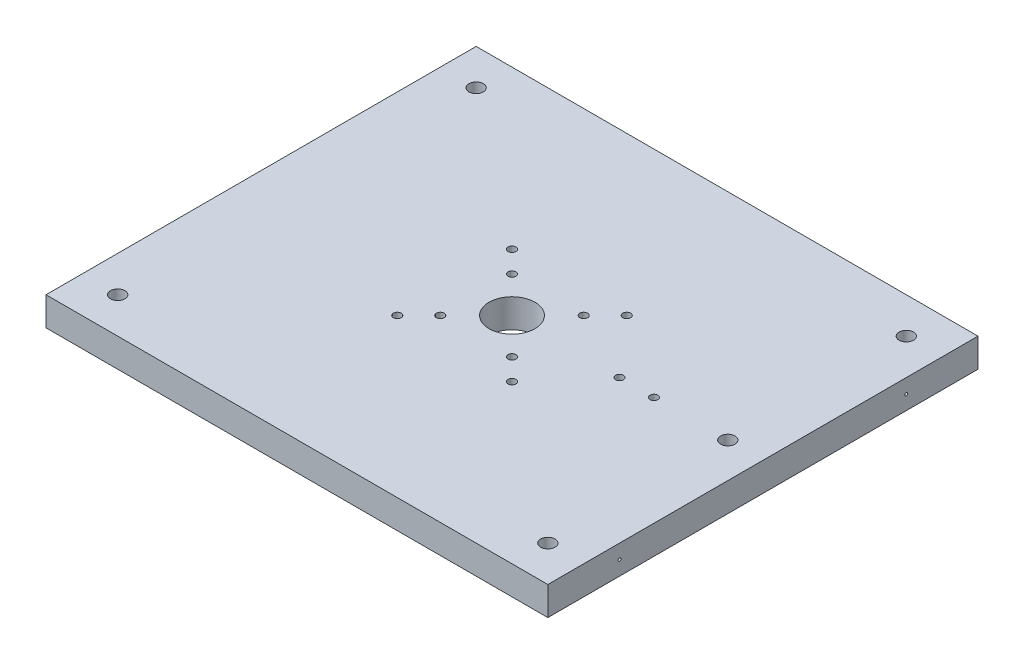
ISO-10303-21;
HEADER;
FILE_DESCRIPTION(('STEP AP214'),'2;1');
FILE_NAME('part.step','',(''),(''),'','','');
FILE_SCHEMA(('AUTOMOTIVE_DESIGN { 1 0 10303 214 1 1 1 1 }'));
ENDSEC;
DATA;
#1=APPLICATION_CONTEXT('core data for automotive mechanical design processes');
#2=APPLICATION_PROTOCOL_DEFINITION('international standard','automotive_design',2000,#1);
#3=PRODUCT_CONTEXT('',#1,'mechanical');
#4=PRODUCT('Part','Part','',(#3));
#5=PRODUCT_RELATED_PRODUCT_CATEGORY('part','',(#4));
#6=PRODUCT_DEFINITION_FORMATION('','',#4);
#7=PRODUCT_DEFINITION_CONTEXT('part definition',#1,'design');
#8=PRODUCT_DEFINITION('design','',#6,#7);
#9=PRODUCT_DEFINITION_SHAPE('','',#8);
#10=(LENGTH_UNIT() NAMED_UNIT(*) SI_UNIT(.MILLI.,.METRE.));
#11=(NAMED_UNIT(*) PLANE_ANGLE_UNIT() SI_UNIT($,.RADIAN.));
#12=(NAMED_UNIT(*) SI_UNIT($,.STERADIAN.) SOLID_ANGLE_UNIT());
#13=UNCERTAINTY_MEASURE_WITH_UNIT(LENGTH_MEASURE(1.E-05),#10,'distance_accuracy_value','');
#14=(GEOMETRIC_REPRESENTATION_CONTEXT(3) GLOBAL_UNCERTAINTY_ASSIGNED_CONTEXT((#13)) GLOBAL_UNIT_ASSIGNED_CONTEXT((#10,
#11,#12)) REPRESENTATION_CONTEXT('',''));
#15=CARTESIAN_POINT('',(0.,0.,0.));
#16=DIRECTION('',(0.,0.,1.));
#17=DIRECTION('',(1.,0.,0.));
#18=AXIS2_PLACEMENT_3D('',#15,#16,#17);
#19=CARTESIAN_POINT('',(-175.,20.,-150.));
#20=DIRECTION('',(1.,0.,0.));
#21=DIRECTION('',(0.,0.,-1.));
#22=AXIS2_PLACEMENT_3D('',#19,#20,#21);
#23=PLANE('',#22);
#24=DIRECTION('',(0.,0.,1.));
#25=VECTOR('',#24,1.);
#26=CARTESIAN_POINT('',(-175.,0.,-150.));
#27=LINE('',#26,#25);
#28=CARTESIAN_POINT('',(-175.,0.,-150.));
#29=VERTEX_POINT('',#28);
#30=CARTESIAN_POINT('',(-175.,0.,150.));
#31=VERTEX_POINT('',#30);
#32=EDGE_CURVE('E97',#29,#31,#27,.T.);
#33=ORIENTED_EDGE('',*,*,#32,.T.);
#34=DIRECTION('',(0.,-1.,0.));
#35=VECTOR('',#34,1.);
#36=CARTESIAN_POINT('',(-175.,20.,150.));
#37=LINE('',#36,#35);
#38=CARTESIAN_POINT('',(-175.,20.,150.));
#39=VERTEX_POINT('',#38);
#40=EDGE_CURVE('E11',#39,#31,#37,.T.);
#41=ORIENTED_EDGE('',*,*,#40,.F.);
#42=DIRECTION('',(0.,0.,1.));
#43=VECTOR('',#42,1.);
#44=CARTESIAN_POINT('',(-175.,20.,-150.));
#45=LINE('',#44,#43);
#46=CARTESIAN_POINT('',(-175.,20.,-150.));
#47=VERTEX_POINT('',#46);
#48=EDGE_CURVE('E85',#47,#39,#45,.T.);
#49=ORIENTED_EDGE('',*,*,#48,.F.);
#50=DIRECTION('',(0.,-1.,0.));
#51=VECTOR('',#50,1.);
#52=CARTESIAN_POINT('',(-175.,20.,-150.));
#53=LINE('',#52,#51);
#54=EDGE_CURVE('E93',#47,#29,#53,.T.);
#55=ORIENTED_EDGE('',*,*,#54,.T.);
#56=EDGE_LOOP('',(#33,#41,#49,#55));
#57=FACE_BOUND('',#56,.T.);
#58=ADVANCED_FACE('F34',(#57),#23,.F.);
#59=CARTESIAN_POINT('',(175.,20.,150.));
#60=DIRECTION('',(0.,0.,-1.));
#61=DIRECTION('',(-1.,0.,0.));
#62=AXIS2_PLACEMENT_3D('',#59,#60,#61);
#63=PLANE('',#62);
#64=DIRECTION('',(1.,0.,0.));
#65=VECTOR('',#64,1.);
#66=CARTESIAN_POINT('',(175.,0.,150.));
#67=LINE('',#66,#65);
#68=CARTESIAN_POINT('',(175.,0.,150.));
#69=VERTEX_POINT('',#68);
#70=EDGE_CURVE('E89',#31,#69,#67,.T.);
#71=ORIENTED_EDGE('',*,*,#70,.T.);
#72=DIRECTION('',(0.,-1.,0.));
#73=VECTOR('',#72,1.);
#74=CARTESIAN_POINT('',(175.,20.,150.));
#75=LINE('',#74,#73);
#76=CARTESIAN_POINT('',(175.,20.,150.));
#77=VERTEX_POINT('',#76);
#78=EDGE_CURVE('E42',#77,#69,#75,.T.);
#79=ORIENTED_EDGE('',*,*,#78,.F.);
#80=DIRECTION('',(1.,0.,0.));
#81=VECTOR('',#80,1.);
#82=CARTESIAN_POINT('',(175.,20.,150.));
#83=LINE('',#82,#81);
#84=EDGE_CURVE('E80',#39,#77,#83,.T.);
#85=ORIENTED_EDGE('',*,*,#84,.F.);
#86=ORIENTED_EDGE('',*,*,#40,.T.);
#87=EDGE_LOOP('',(#71,#79,#85,#86));
#88=FACE_BOUND('',#87,.T.);
#89=ADVANCED_FACE('F88',(#88),#63,.F.);
#90=CARTESIAN_POINT('',(175.,20.,-150.));
#91=DIRECTION('',(-1.,0.,0.));
#92=DIRECTION('',(0.,0.,1.));
#93=AXIS2_PLACEMENT_3D('',#90,#91,#92);
#94=PLANE('',#93);
#95=CARTESIAN_POINT('',(175.,10.,100.));
#96=DIRECTION('',(1.,0.,0.));
#97=DIRECTION('',(0.,0.,-1.));
#98=AXIS2_PLACEMENT_3D('',#95,#96,#97);
#99=CIRCLE('',#98,0.999999999999998);
#100=CARTESIAN_POINT('',(175.,10.,99.));
#101=VERTEX_POINT('',#100);
#102=EDGE_CURVE('E213',#101,#101,#99,.T.);
#103=ORIENTED_EDGE('',*,*,#102,.F.);
#104=EDGE_LOOP('',(#103));
#105=FACE_BOUND('',#104,.T.);
#106=CARTESIAN_POINT('',(175.,10.,-100.));
#107=DIRECTION('',(1.,0.,0.));
#108=DIRECTION('',(0.,0.,-1.));
#109=AXIS2_PLACEMENT_3D('',#106,#107,#108);
#110=CIRCLE('',#109,0.999999999999998);
#111=CARTESIAN_POINT('',(175.,10.,-101.));
#112=VERTEX_POINT('',#111);
#113=EDGE_CURVE('E207',#112,#112,#110,.T.);
#114=ORIENTED_EDGE('',*,*,#113,.F.);
#115=EDGE_LOOP('',(#114));
#116=FACE_BOUND('',#115,.T.);
#117=DIRECTION('',(0.,0.,-1.));
#118=VECTOR('',#117,1.);
#119=CARTESIAN_POINT('',(175.,0.,-150.));
#120=LINE('',#119,#118);
#121=CARTESIAN_POINT('',(175.,0.,-150.));
#122=VERTEX_POINT('',#121);
#123=EDGE_CURVE('E67',#69,#122,#120,.T.);
#124=ORIENTED_EDGE('',*,*,#123,.T.);
#125=DIRECTION('',(0.,-1.,0.));
#126=VECTOR('',#125,1.);
#127=CARTESIAN_POINT('',(175.,20.,-150.));
#128=LINE('',#127,#126);
#129=CARTESIAN_POINT('',(175.,20.,-150.));
#130=VERTEX_POINT('',#129);
#131=EDGE_CURVE('E90',#130,#122,#128,.T.);
#132=ORIENTED_EDGE('',*,*,#131,.F.);
#133=DIRECTION('',(0.,0.,-1.));
#134=VECTOR('',#133,1.);
#135=CARTESIAN_POINT('',(175.,20.,-150.));
#136=LINE('',#135,#134);
#137=EDGE_CURVE('E83',#77,#130,#136,.T.);
#138=ORIENTED_EDGE('',*,*,#137,.F.);
#139=ORIENTED_EDGE('',*,*,#78,.T.);
#140=EDGE_LOOP('',(#124,#132,#138,#139));
#141=FACE_BOUND('',#140,.T.);
#142=ADVANCED_FACE('F91',(#105,#116,#141),#94,.F.);
#143=CARTESIAN_POINT('',(175.,20.,-150.));
#144=DIRECTION('',(0.,0.,1.));
#145=DIRECTION('',(1.,0.,0.));
#146=AXIS2_PLACEMENT_3D('',#143,#144,#145);
#147=PLANE('',#146);
#148=DIRECTION('',(-1.,0.,0.));
#149=VECTOR('',#148,1.);
#150=CARTESIAN_POINT('',(175.,0.,-150.));
#151=LINE('',#150,#149);
#152=EDGE_CURVE('E73',#122,#29,#151,.T.);
#153=ORIENTED_EDGE('',*,*,#152,.T.);
#154=ORIENTED_EDGE('',*,*,#54,.F.);
#155=DIRECTION('',(-1.,0.,0.));
#156=VECTOR('',#155,1.);
#157=CARTESIAN_POINT('',(175.,20.,-150.));
#158=LINE('',#157,#156);
#159=EDGE_CURVE('E50',#130,#47,#158,.T.);
#160=ORIENTED_EDGE('',*,*,#159,.F.);
#161=ORIENTED_EDGE('',*,*,#131,.T.);
#162=EDGE_LOOP('',(#153,#154,#160,#161));
#163=FACE_BOUND('',#162,.T.);
#164=ADVANCED_FACE('F105',(#163),#147,.F.);
#165=CARTESIAN_POINT('',(0.,20.,0.));
#166=DIRECTION('',(0.,-1.,0.));
#167=DIRECTION('',(0.,0.,-1.));
#168=AXIS2_PLACEMENT_3D('',#165,#166,#167);
#169=PLANE('',#168);
#170=CARTESIAN_POINT('',(-24.9999999999995,20.,25.));
#171=DIRECTION('',(0.,1.,0.));
#172=DIRECTION('',(0.,0.,1.));
#173=AXIS2_PLACEMENT_3D('',#170,#171,#172);
#174=CIRCLE('',#173,2.75);
#175=CARTESIAN_POINT('',(-24.9999999999995,20.,27.75));
#176=VERTEX_POINT('',#175);
#177=EDGE_CURVE('E189',#176,#176,#174,.T.);
#178=ORIENTED_EDGE('',*,*,#177,.F.);
#179=EDGE_LOOP('',(#178));
#180=FACE_BOUND('',#179,.T.);
#181=CARTESIAN_POINT('',(25.0000000000005,20.,25.));
#182=DIRECTION('',(0.,1.,0.));
#183=DIRECTION('',(0.,0.,1.));
#184=AXIS2_PLACEMENT_3D('',#181,#182,#183);
#185=CIRCLE('',#184,2.75);
#186=CARTESIAN_POINT('',(25.0000000000005,20.,27.75));
#187=VERTEX_POINT('',#186);
#188=EDGE_CURVE('E196',#187,#187,#185,.T.);
#189=ORIENTED_EDGE('',*,*,#188,.F.);
#190=EDGE_LOOP('',(#189));
#191=FACE_BOUND('',#190,.T.);
#192=CARTESIAN_POINT('',(25.,20.,-25.));
#193=DIRECTION('',(0.,1.,0.));
#194=DIRECTION('',(0.,0.,1.));
#195=AXIS2_PLACEMENT_3D('',#192,#193,#194);
#196=CIRCLE('',#195,2.75);
#197=CARTESIAN_POINT('',(25.,20.,-22.25));
#198=VERTEX_POINT('',#197);
#199=EDGE_CURVE('E202',#198,#198,#196,.T.);
#200=ORIENTED_EDGE('',*,*,#199,.F.);
#201=EDGE_LOOP('',(#200));
#202=FACE_BOUND('',#201,.T.);
#203=CARTESIAN_POINT('',(-25.,20.,-25.));
#204=DIRECTION('',(0.,1.,0.));
#205=DIRECTION('',(0.,0.,1.));
#206=AXIS2_PLACEMENT_3D('',#203,#204,#205);
#207=CIRCLE('',#206,2.75);
#208=CARTESIAN_POINT('',(-25.,20.,-22.25));
#209=VERTEX_POINT('',#208);
#210=EDGE_CURVE('E183',#209,#209,#207,.T.);
#211=ORIENTED_EDGE('',*,*,#210,.F.);
#212=EDGE_LOOP('',(#211));
#213=FACE_BOUND('',#212,.T.);
#214=CARTESIAN_POINT('',(0.,20.,0.));
#215=DIRECTION('',(0.,1.,0.));
#216=DIRECTION('',(0.,0.,1.));
#217=AXIS2_PLACEMENT_3D('',#214,#215,#216);
#218=CIRCLE('',#217,16.);
#219=CARTESIAN_POINT('',(0.,20.,16.));
#220=VERTEX_POINT('',#219);
#221=EDGE_CURVE('E177',#220,#220,#218,.T.);
#222=ORIENTED_EDGE('',*,*,#221,.F.);
#223=EDGE_LOOP('',(#222));
#224=FACE_BOUND('',#223,.T.);
#225=CARTESIAN_POINT('',(-39.9999999999992,20.,40.));
#226=DIRECTION('',(0.,1.,0.));
#227=DIRECTION('',(0.,0.,1.));
#228=AXIS2_PLACEMENT_3D('',#225,#226,#227);
#229=CIRCLE('',#228,2.75);
#230=CARTESIAN_POINT('',(-39.9999999999992,20.,42.75));
#231=VERTEX_POINT('',#230);
#232=EDGE_CURVE('E159',#231,#231,#229,.T.);
#233=ORIENTED_EDGE('',*,*,#232,.F.);
#234=EDGE_LOOP('',(#233));
#235=FACE_BOUND('',#234,.T.);
#236=CARTESIAN_POINT('',(40.0000000000008,20.,40.));
#237=DIRECTION('',(0.,1.,0.));
#238=DIRECTION('',(0.,0.,1.));
#239=AXIS2_PLACEMENT_3D('',#236,#237,#238);
#240=CIRCLE('',#239,2.75);
#241=CARTESIAN_POINT('',(40.0000000000008,20.,42.75));
#242=VERTEX_POINT('',#241);
#243=EDGE_CURVE('E166',#242,#242,#240,.T.);
#244=ORIENTED_EDGE('',*,*,#243,.F.);
#245=EDGE_LOOP('',(#244));
#246=FACE_BOUND('',#245,.T.);
#247=CARTESIAN_POINT('',(40.,20.,-40.));
#248=DIRECTION('',(0.,1.,0.));
#249=DIRECTION('',(0.,0.,1.));
#250=AXIS2_PLACEMENT_3D('',#247,#248,#249);
#251=CIRCLE('',#250,2.75);
#252=CARTESIAN_POINT('',(40.,20.,-37.25));
#253=VERTEX_POINT('',#252);
#254=EDGE_CURVE('E172',#253,#253,#251,.T.);
#255=ORIENTED_EDGE('',*,*,#254,.F.);
#256=EDGE_LOOP('',(#255));
#257=FACE_BOUND('',#256,.T.);
#258=CARTESIAN_POINT('',(-40.,20.,-40.));
#259=DIRECTION('',(0.,1.,0.));
#260=DIRECTION('',(0.,0.,1.));
#261=AXIS2_PLACEMENT_3D('',#258,#259,#260);
#262=CIRCLE('',#261,2.75);
#263=CARTESIAN_POINT('',(-40.,20.,-37.25));
#264=VERTEX_POINT('',#263);
#265=EDGE_CURVE('E153',#264,#264,#262,.T.);
#266=ORIENTED_EDGE('',*,*,#265,.F.);
#267=EDGE_LOOP('',(#266));
#268=FACE_BOUND('',#267,.T.);
#269=CARTESIAN_POINT('',(150.5,20.,0.));
#270=DIRECTION('',(0.,1.,0.));
#271=DIRECTION('',(0.,0.,1.));
#272=AXIS2_PLACEMENT_3D('',#269,#270,#271);
#273=CIRCLE('',#272,5.00000000000002);
#274=CARTESIAN_POINT('',(150.5,20.,5.00000000000002));
#275=VERTEX_POINT('',#274);
#276=EDGE_CURVE('E147',#275,#275,#273,.T.);
#277=ORIENTED_EDGE('',*,*,#276,.F.);
#278=EDGE_LOOP('',(#277));
#279=FACE_BOUND('',#278,.T.);
#280=CARTESIAN_POINT('',(75.0000000000001,20.,0.));
#281=DIRECTION('',(0.,1.,0.));
#282=DIRECTION('',(0.,0.,1.));
#283=AXIS2_PLACEMENT_3D('',#280,#281,#282);
#284=CIRCLE('',#283,2.75000000000001);
#285=CARTESIAN_POINT('',(75.0000000000001,20.,2.75000000000001));
#286=VERTEX_POINT('',#285);
#287=EDGE_CURVE('E142',#286,#286,#284,.T.);
#288=ORIENTED_EDGE('',*,*,#287,.F.);
#289=EDGE_LOOP('',(#288));
#290=FACE_BOUND('',#289,.T.);
#291=CARTESIAN_POINT('',(99.0000000000001,20.,0.));
#292=DIRECTION('',(0.,1.,0.));
#293=DIRECTION('',(0.,0.,1.));
#294=AXIS2_PLACEMENT_3D('',#291,#292,#293);
#295=CIRCLE('',#294,2.75000000000001);
#296=CARTESIAN_POINT('',(99.0000000000001,20.,2.75000000000001));
#297=VERTEX_POINT('',#296);
#298=EDGE_CURVE('E135',#297,#297,#295,.T.);
#299=ORIENTED_EDGE('',*,*,#298,.F.);
#300=EDGE_LOOP('',(#299));
#301=FACE_BOUND('',#300,.T.);
#302=CARTESIAN_POINT('',(150.,20.,125.));
#303=DIRECTION('',(0.,1.,0.));
#304=DIRECTION('',(0.,0.,1.));
#305=AXIS2_PLACEMENT_3D('',#302,#303,#304);
#306=CIRCLE('',#305,5.00000000000002);
#307=CARTESIAN_POINT('',(150.,20.,130.));
#308=VERTEX_POINT('',#307);
#309=EDGE_CURVE('E117',#308,#308,#306,.T.);
#310=ORIENTED_EDGE('',*,*,#309,.F.);
#311=EDGE_LOOP('',(#310));
#312=FACE_BOUND('',#311,.T.);
#313=CARTESIAN_POINT('',(150.,20.,-125.));
#314=DIRECTION('',(0.,1.,0.));
#315=DIRECTION('',(0.,0.,1.));
#316=AXIS2_PLACEMENT_3D('',#313,#314,#315);
#317=CIRCLE('',#316,5.00000000000002);
#318=CARTESIAN_POINT('',(150.,20.,-120.));
#319=VERTEX_POINT('',#318);
#320=EDGE_CURVE('E124',#319,#319,#317,.T.);
#321=ORIENTED_EDGE('',*,*,#320,.F.);
#322=EDGE_LOOP('',(#321));
#323=FACE_BOUND('',#322,.T.);
#324=CARTESIAN_POINT('',(-150.,20.,-125.));
#325=DIRECTION('',(0.,1.,0.));
#326=DIRECTION('',(0.,0.,1.));
#327=AXIS2_PLACEMENT_3D('',#324,#325,#326);
#328=CIRCLE('',#327,5.00000000000002);
#329=CARTESIAN_POINT('',(-150.,20.,-120.));
#330=VERTEX_POINT('',#329);
#331=EDGE_CURVE('E130',#330,#330,#328,.T.);
#332=ORIENTED_EDGE('',*,*,#331,.F.);
#333=EDGE_LOOP('',(#332));
#334=FACE_BOUND('',#333,.T.);
#335=CARTESIAN_POINT('',(-150.,20.,125.));
#336=DIRECTION('',(0.,1.,0.));
#337=DIRECTION('',(0.,0.,1.));
#338=AXIS2_PLACEMENT_3D('',#335,#336,#337);
#339=CIRCLE('',#338,5.00000000000002);
#340=CARTESIAN_POINT('',(-150.,20.,130.));
#341=VERTEX_POINT('',#340);
#342=EDGE_CURVE('E111',#341,#341,#339,.T.);
#343=ORIENTED_EDGE('',*,*,#342,.F.);
#344=EDGE_LOOP('',(#343));
#345=FACE_BOUND('',#344,.T.);
#346=ORIENTED_EDGE('',*,*,#48,.T.);
#347=ORIENTED_EDGE('',*,*,#84,.T.);
#348=ORIENTED_EDGE('',*,*,#137,.T.);
#349=ORIENTED_EDGE('',*,*,#159,.T.);
#350=EDGE_LOOP('',(#346,#347,#348,#349));
#351=FACE_BOUND('',#350,.T.);
#352=ADVANCED_FACE('F81',(#180,#191,#202,#213,#224,#235,#246,#257,#268,#279,#290,#301,#312,#323,
#334,#345,#351),#169,.F.);
#353=CARTESIAN_POINT('',(0.,0.,0.));
#354=DIRECTION('',(0.,-1.,0.));
#355=DIRECTION('',(0.,0.,-1.));
#356=AXIS2_PLACEMENT_3D('',#353,#354,#355);
#357=PLANE('',#356);
#358=CARTESIAN_POINT('',(-24.9999999999995,0.,25.));
#359=DIRECTION('',(0.,1.,0.));
#360=DIRECTION('',(0.,0.,1.));
#361=AXIS2_PLACEMENT_3D('',#358,#359,#360);
#362=CIRCLE('',#361,2.75);
#363=CARTESIAN_POINT('',(-24.9999999999995,0.,27.75));
#364=VERTEX_POINT('',#363);
#365=EDGE_CURVE('E192',#364,#364,#362,.T.);
#366=ORIENTED_EDGE('',*,*,#365,.T.);
#367=EDGE_LOOP('',(#366));
#368=FACE_BOUND('',#367,.T.);
#369=CARTESIAN_POINT('',(25.0000000000005,0.,25.));
#370=DIRECTION('',(0.,1.,0.));
#371=DIRECTION('',(0.,0.,1.));
#372=AXIS2_PLACEMENT_3D('',#369,#370,#371);
#373=CIRCLE('',#372,2.75);
#374=CARTESIAN_POINT('',(25.0000000000005,0.,27.75));
#375=VERTEX_POINT('',#374);
#376=EDGE_CURVE('E199',#375,#375,#373,.T.);
#377=ORIENTED_EDGE('',*,*,#376,.T.);
#378=EDGE_LOOP('',(#377));
#379=FACE_BOUND('',#378,.T.);
#380=CARTESIAN_POINT('',(25.,0.,-25.));
#381=DIRECTION('',(0.,1.,0.));
#382=DIRECTION('',(0.,0.,1.));
#383=AXIS2_PLACEMENT_3D('',#380,#381,#382);
#384=CIRCLE('',#383,2.75);
#385=CARTESIAN_POINT('',(25.,0.,-22.25));
#386=VERTEX_POINT('',#385);
#387=EDGE_CURVE('E186',#386,#386,#384,.T.);
#388=ORIENTED_EDGE('',*,*,#387,.T.);
#389=EDGE_LOOP('',(#388));
#390=FACE_BOUND('',#389,.T.);
#391=CARTESIAN_POINT('',(-25.,0.,-25.));
#392=DIRECTION('',(0.,1.,0.));
#393=DIRECTION('',(0.,0.,1.));
#394=AXIS2_PLACEMENT_3D('',#391,#392,#393);
#395=CIRCLE('',#394,2.75);
#396=CARTESIAN_POINT('',(-25.,0.,-22.25));
#397=VERTEX_POINT('',#396);
#398=EDGE_CURVE('E180',#397,#397,#395,.T.);
#399=ORIENTED_EDGE('',*,*,#398,.T.);
#400=EDGE_LOOP('',(#399));
#401=FACE_BOUND('',#400,.T.);
#402=CARTESIAN_POINT('',(0.,0.,0.));
#403=DIRECTION('',(0.,1.,0.));
#404=DIRECTION('',(0.,0.,1.));
#405=AXIS2_PLACEMENT_3D('',#402,#403,#404);
#406=CIRCLE('',#405,16.);
#407=CARTESIAN_POINT('',(0.,0.,16.));
#408=VERTEX_POINT('',#407);
#409=EDGE_CURVE('E163',#408,#408,#406,.T.);
#410=ORIENTED_EDGE('',*,*,#409,.T.);
#411=EDGE_LOOP('',(#410));
#412=FACE_BOUND('',#411,.T.);
#413=CARTESIAN_POINT('',(-39.9999999999992,0.,40.));
#414=DIRECTION('',(0.,1.,0.));
#415=DIRECTION('',(0.,0.,1.));
#416=AXIS2_PLACEMENT_3D('',#413,#414,#415);
#417=CIRCLE('',#416,2.75);
#418=CARTESIAN_POINT('',(-39.9999999999992,0.,42.75));
#419=VERTEX_POINT('',#418);
#420=EDGE_CURVE('E162',#419,#419,#417,.T.);
#421=ORIENTED_EDGE('',*,*,#420,.T.);
#422=EDGE_LOOP('',(#421));
#423=FACE_BOUND('',#422,.T.);
#424=CARTESIAN_POINT('',(40.0000000000008,0.,40.));
#425=DIRECTION('',(0.,1.,0.));
#426=DIRECTION('',(0.,0.,1.));
#427=AXIS2_PLACEMENT_3D('',#424,#425,#426);
#428=CIRCLE('',#427,2.75);
#429=CARTESIAN_POINT('',(40.0000000000008,0.,42.75));
#430=VERTEX_POINT('',#429);
#431=EDGE_CURVE('E169',#430,#430,#428,.T.);
#432=ORIENTED_EDGE('',*,*,#431,.T.);
#433=EDGE_LOOP('',(#432));
#434=FACE_BOUND('',#433,.T.);
#435=CARTESIAN_POINT('',(40.,0.,-40.));
#436=DIRECTION('',(0.,1.,0.));
#437=DIRECTION('',(0.,0.,1.));
#438=AXIS2_PLACEMENT_3D('',#435,#436,#437);
#439=CIRCLE('',#438,2.75);
#440=CARTESIAN_POINT('',(40.,0.,-37.25));
#441=VERTEX_POINT('',#440);
#442=EDGE_CURVE('E156',#441,#441,#439,.T.);
#443=ORIENTED_EDGE('',*,*,#442,.T.);
#444=EDGE_LOOP('',(#443));
#445=FACE_BOUND('',#444,.T.);
#446=CARTESIAN_POINT('',(-40.,0.,-40.));
#447=DIRECTION('',(0.,1.,0.));
#448=DIRECTION('',(0.,0.,1.));
#449=AXIS2_PLACEMENT_3D('',#446,#447,#448);
#450=CIRCLE('',#449,2.75);
#451=CARTESIAN_POINT('',(-40.,0.,-37.25));
#452=VERTEX_POINT('',#451);
#453=EDGE_CURVE('E150',#452,#452,#450,.T.);
#454=ORIENTED_EDGE('',*,*,#453,.T.);
#455=EDGE_LOOP('',(#454));
#456=FACE_BOUND('',#455,.T.);
#457=CARTESIAN_POINT('',(150.5,0.,0.));
#458=DIRECTION('',(0.,1.,0.));
#459=DIRECTION('',(0.,0.,1.));
#460=AXIS2_PLACEMENT_3D('',#457,#458,#459);
#461=CIRCLE('',#460,5.00000000000002);
#462=CARTESIAN_POINT('',(150.5,0.,5.00000000000002));
#463=VERTEX_POINT('',#462);
#464=EDGE_CURVE('E139',#463,#463,#461,.T.);
#465=ORIENTED_EDGE('',*,*,#464,.T.);
#466=EDGE_LOOP('',(#465));
#467=FACE_BOUND('',#466,.T.);
#468=CARTESIAN_POINT('',(75.0000000000001,0.,0.));
#469=DIRECTION('',(0.,1.,0.));
#470=DIRECTION('',(0.,0.,1.));
#471=AXIS2_PLACEMENT_3D('',#468,#469,#470);
#472=CIRCLE('',#471,2.75000000000001);
#473=CARTESIAN_POINT('',(75.0000000000001,0.,2.75000000000001));
#474=VERTEX_POINT('',#473);
#475=EDGE_CURVE('E121',#474,#474,#472,.T.);
#476=ORIENTED_EDGE('',*,*,#475,.T.);
#477=EDGE_LOOP('',(#476));
#478=FACE_BOUND('',#477,.T.);
#479=CARTESIAN_POINT('',(99.0000000000001,0.,0.));
#480=DIRECTION('',(0.,1.,0.));
#481=DIRECTION('',(0.,0.,1.));
#482=AXIS2_PLACEMENT_3D('',#479,#480,#481);
#483=CIRCLE('',#482,2.75000000000001);
#484=CARTESIAN_POINT('',(99.0000000000001,0.,2.75000000000001));
#485=VERTEX_POINT('',#484);
#486=EDGE_CURVE('E138',#485,#485,#483,.T.);
#487=ORIENTED_EDGE('',*,*,#486,.T.);
#488=EDGE_LOOP('',(#487));
#489=FACE_BOUND('',#488,.T.);
#490=CARTESIAN_POINT('',(150.,0.,125.));
#491=DIRECTION('',(0.,1.,0.));
#492=DIRECTION('',(0.,0.,1.));
#493=AXIS2_PLACEMENT_3D('',#490,#491,#492);
#494=CIRCLE('',#493,5.00000000000002);
#495=CARTESIAN_POINT('',(150.,0.,130.));
#496=VERTEX_POINT('',#495);
#497=EDGE_CURVE('E120',#496,#496,#494,.T.);
#498=ORIENTED_EDGE('',*,*,#497,.T.);
#499=EDGE_LOOP('',(#498));
#500=FACE_BOUND('',#499,.T.);
#501=CARTESIAN_POINT('',(150.,0.,-125.));
#502=DIRECTION('',(0.,1.,0.));
#503=DIRECTION('',(0.,0.,1.));
#504=AXIS2_PLACEMENT_3D('',#501,#502,#503);
#505=CIRCLE('',#504,5.00000000000002);
#506=CARTESIAN_POINT('',(150.,0.,-120.));
#507=VERTEX_POINT('',#506);
#508=EDGE_CURVE('E127',#507,#507,#505,.T.);
#509=ORIENTED_EDGE('',*,*,#508,.T.);
#510=EDGE_LOOP('',(#509));
#511=FACE_BOUND('',#510,.T.);
#512=CARTESIAN_POINT('',(-150.,0.,-125.));
#513=DIRECTION('',(0.,1.,0.));
#514=DIRECTION('',(0.,0.,1.));
#515=AXIS2_PLACEMENT_3D('',#512,#513,#514);
#516=CIRCLE('',#515,5.00000000000002);
#517=CARTESIAN_POINT('',(-150.,0.,-120.));
#518=VERTEX_POINT('',#517);
#519=EDGE_CURVE('E114',#518,#518,#516,.T.);
#520=ORIENTED_EDGE('',*,*,#519,.T.);
#521=EDGE_LOOP('',(#520));
#522=FACE_BOUND('',#521,.T.);
#523=CARTESIAN_POINT('',(-150.,0.,125.));
#524=DIRECTION('',(0.,1.,0.));
#525=DIRECTION('',(0.,0.,1.));
#526=AXIS2_PLACEMENT_3D('',#523,#524,#525);
#527=CIRCLE('',#526,5.00000000000002);
#528=CARTESIAN_POINT('',(-150.,0.,130.));
#529=VERTEX_POINT('',#528);
#530=EDGE_CURVE('E100',#529,#529,#527,.T.);
#531=ORIENTED_EDGE('',*,*,#530,.T.);
#532=EDGE_LOOP('',(#531));
#533=FACE_BOUND('',#532,.T.);
#534=ORIENTED_EDGE('',*,*,#32,.F.);
#535=ORIENTED_EDGE('',*,*,#152,.F.);
#536=ORIENTED_EDGE('',*,*,#123,.F.);
#537=ORIENTED_EDGE('',*,*,#70,.F.);
#538=EDGE_LOOP('',(#534,#535,#536,#537));
#539=FACE_BOUND('',#538,.T.);
#540=ADVANCED_FACE('F108',(#368,#379,#390,#401,#412,#423,#434,#445,#456,#467,#478,#489,#500,
#511,#522,#533,#539),#357,.T.);
#541=CARTESIAN_POINT('',(-150.,0.,125.));
#542=DIRECTION('',(0.,1.,0.));
#543=DIRECTION('',(0.,0.,1.));
#544=AXIS2_PLACEMENT_3D('',#541,#542,#543);
#545=CYLINDRICAL_SURFACE('',#544,5.00000000000002);
#546=ORIENTED_EDGE('',*,*,#530,.F.);
#547=EDGE_LOOP('',(#546));
#548=FACE_BOUND('',#547,.T.);
#549=ORIENTED_EDGE('',*,*,#342,.T.);
#550=EDGE_LOOP('',(#549));
#551=FACE_BOUND('',#550,.T.);
#552=ADVANCED_FACE('F261',(#548,#551),#545,.F.);
#553=CARTESIAN_POINT('',(-150.,0.,-125.));
#554=DIRECTION('',(0.,1.,0.));
#555=DIRECTION('',(0.,0.,1.));
#556=AXIS2_PLACEMENT_3D('',#553,#554,#555);
#557=CYLINDRICAL_SURFACE('',#556,5.00000000000002);
#558=ORIENTED_EDGE('',*,*,#519,.F.);
#559=EDGE_LOOP('',(#558));
#560=FACE_BOUND('',#559,.T.);
#561=ORIENTED_EDGE('',*,*,#331,.T.);
#562=EDGE_LOOP('',(#561));
#563=FACE_BOUND('',#562,.T.);
#564=ADVANCED_FACE('F268',(#560,#563),#557,.F.);
#565=CARTESIAN_POINT('',(150.,0.,-125.));
#566=DIRECTION('',(0.,1.,0.));
#567=DIRECTION('',(0.,0.,1.));
#568=AXIS2_PLACEMENT_3D('',#565,#566,#567);
#569=CYLINDRICAL_SURFACE('',#568,5.00000000000002);
#570=ORIENTED_EDGE('',*,*,#508,.F.);
#571=EDGE_LOOP('',(#570));
#572=FACE_BOUND('',#571,.T.);
#573=ORIENTED_EDGE('',*,*,#320,.T.);
#574=EDGE_LOOP('',(#573));
#575=FACE_BOUND('',#574,.T.);
#576=ADVANCED_FACE('F274',(#572,#575),#569,.F.);
#577=CARTESIAN_POINT('',(150.,0.,125.));
#578=DIRECTION('',(0.,1.,0.));
#579=DIRECTION('',(0.,0.,1.));
#580=AXIS2_PLACEMENT_3D('',#577,#578,#579);
#581=CYLINDRICAL_SURFACE('',#580,5.00000000000002);
#582=ORIENTED_EDGE('',*,*,#497,.F.);
#583=EDGE_LOOP('',(#582));
#584=FACE_BOUND('',#583,.T.);
#585=ORIENTED_EDGE('',*,*,#309,.T.);
#586=EDGE_LOOP('',(#585));
#587=FACE_BOUND('',#586,.T.);
#588=ADVANCED_FACE('F270',(#584,#587),#581,.F.);
#589=CARTESIAN_POINT('',(99.0000000000001,0.,0.));
#590=DIRECTION('',(0.,1.,0.));
#591=DIRECTION('',(0.,0.,1.));
#592=AXIS2_PLACEMENT_3D('',#589,#590,#591);
#593=CYLINDRICAL_SURFACE('',#592,2.75000000000001);
#594=ORIENTED_EDGE('',*,*,#486,.F.);
#595=EDGE_LOOP('',(#594));
#596=FACE_BOUND('',#595,.T.);
#597=ORIENTED_EDGE('',*,*,#298,.T.);
#598=EDGE_LOOP('',(#597));
#599=FACE_BOUND('',#598,.T.);
#600=ADVANCED_FACE('F273',(#596,#599),#593,.F.);
#601=CARTESIAN_POINT('',(75.0000000000001,0.,0.));
#602=DIRECTION('',(0.,1.,0.));
#603=DIRECTION('',(0.,0.,1.));
#604=AXIS2_PLACEMENT_3D('',#601,#602,#603);
#605=CYLINDRICAL_SURFACE('',#604,2.75000000000001);
#606=ORIENTED_EDGE('',*,*,#475,.F.);
#607=EDGE_LOOP('',(#606));
#608=FACE_BOUND('',#607,.T.);
#609=ORIENTED_EDGE('',*,*,#287,.T.);
#610=EDGE_LOOP('',(#609));
#611=FACE_BOUND('',#610,.T.);
#612=ADVANCED_FACE('F284',(#608,#611),#605,.F.);
#613=CARTESIAN_POINT('',(150.5,0.,0.));
#614=DIRECTION('',(0.,1.,0.));
#615=DIRECTION('',(0.,0.,1.));
#616=AXIS2_PLACEMENT_3D('',#613,#614,#615);
#617=CYLINDRICAL_SURFACE('',#616,5.00000000000002);
#618=ORIENTED_EDGE('',*,*,#464,.F.);
#619=EDGE_LOOP('',(#618));
#620=FACE_BOUND('',#619,.T.);
#621=ORIENTED_EDGE('',*,*,#276,.T.);
#622=EDGE_LOOP('',(#621));
#623=FACE_BOUND('',#622,.T.);
#624=ADVANCED_FACE('F288',(#620,#623),#617,.F.);
#625=CARTESIAN_POINT('',(-40.,0.,-40.));
#626=DIRECTION('',(0.,1.,0.));
#627=DIRECTION('',(0.,0.,1.));
#628=AXIS2_PLACEMENT_3D('',#625,#626,#627);
#629=CYLINDRICAL_SURFACE('',#628,2.75);
#630=ORIENTED_EDGE('',*,*,#453,.F.);
#631=EDGE_LOOP('',(#630));
#632=FACE_BOUND('',#631,.T.);
#633=ORIENTED_EDGE('',*,*,#265,.T.);
#634=EDGE_LOOP('',(#633));
#635=FACE_BOUND('',#634,.T.);
#636=ADVANCED_FACE('F292',(#632,#635),#629,.F.);
#637=CARTESIAN_POINT('',(40.,0.,-40.));
#638=DIRECTION('',(0.,1.,0.));
#639=DIRECTION('',(0.,0.,1.));
#640=AXIS2_PLACEMENT_3D('',#637,#638,#639);
#641=CYLINDRICAL_SURFACE('',#640,2.75);
#642=ORIENTED_EDGE('',*,*,#442,.F.);
#643=EDGE_LOOP('',(#642));
#644=FACE_BOUND('',#643,.T.);
#645=ORIENTED_EDGE('',*,*,#254,.T.);
#646=EDGE_LOOP('',(#645));
#647=FACE_BOUND('',#646,.T.);
#648=ADVANCED_FACE('F296',(#644,#647),#641,.F.);
#649=CARTESIAN_POINT('',(40.0000000000008,0.,40.));
#650=DIRECTION('',(0.,1.,0.));
#651=DIRECTION('',(0.,0.,1.));
#652=AXIS2_PLACEMENT_3D('',#649,#650,#651);
#653=CYLINDRICAL_SURFACE('',#652,2.75);
#654=ORIENTED_EDGE('',*,*,#431,.F.);
#655=EDGE_LOOP('',(#654));
#656=FACE_BOUND('',#655,.T.);
#657=ORIENTED_EDGE('',*,*,#243,.T.);
#658=EDGE_LOOP('',(#657));
#659=FACE_BOUND('',#658,.T.);
#660=ADVANCED_FACE('F302',(#656,#659),#653,.F.);
#661=CARTESIAN_POINT('',(-39.9999999999992,0.,40.));
#662=DIRECTION('',(0.,1.,0.));
#663=DIRECTION('',(0.,0.,1.));
#664=AXIS2_PLACEMENT_3D('',#661,#662,#663);
#665=CYLINDRICAL_SURFACE('',#664,2.75);
#666=ORIENTED_EDGE('',*,*,#420,.F.);
#667=EDGE_LOOP('',(#666));
#668=FACE_BOUND('',#667,.T.);
#669=ORIENTED_EDGE('',*,*,#232,.T.);
#670=EDGE_LOOP('',(#669));
#671=FACE_BOUND('',#670,.T.);
#672=ADVANCED_FACE('F298',(#668,#671),#665,.F.);
#673=CARTESIAN_POINT('',(0.,0.,0.));
#674=DIRECTION('',(0.,1.,0.));
#675=DIRECTION('',(0.,0.,1.));
#676=AXIS2_PLACEMENT_3D('',#673,#674,#675);
#677=CYLINDRICAL_SURFACE('',#676,16.);
#678=ORIENTED_EDGE('',*,*,#409,.F.);
#679=EDGE_LOOP('',(#678));
#680=FACE_BOUND('',#679,.T.);
#681=ORIENTED_EDGE('',*,*,#221,.T.);
#682=EDGE_LOOP('',(#681));
#683=FACE_BOUND('',#682,.T.);
#684=ADVANCED_FACE('F301',(#680,#683),#677,.F.);
#685=CARTESIAN_POINT('',(-25.,0.,-25.));
#686=DIRECTION('',(0.,1.,0.));
#687=DIRECTION('',(0.,0.,1.));
#688=AXIS2_PLACEMENT_3D('',#685,#686,#687);
#689=CYLINDRICAL_SURFACE('',#688,2.75);
#690=ORIENTED_EDGE('',*,*,#398,.F.);
#691=EDGE_LOOP('',(#690));
#692=FACE_BOUND('',#691,.T.);
#693=ORIENTED_EDGE('',*,*,#210,.T.);
#694=EDGE_LOOP('',(#693));
#695=FACE_BOUND('',#694,.T.);
#696=ADVANCED_FACE('F312',(#692,#695),#689,.F.);
#697=CARTESIAN_POINT('',(25.,0.,-25.));
#698=DIRECTION('',(0.,1.,0.));
#699=DIRECTION('',(0.,0.,1.));
#700=AXIS2_PLACEMENT_3D('',#697,#698,#699);
#701=CYLINDRICAL_SURFACE('',#700,2.75);
#702=ORIENTED_EDGE('',*,*,#387,.F.);
#703=EDGE_LOOP('',(#702));
#704=FACE_BOUND('',#703,.T.);
#705=ORIENTED_EDGE('',*,*,#199,.T.);
#706=EDGE_LOOP('',(#705));
#707=FACE_BOUND('',#706,.T.);
#708=ADVANCED_FACE('F315',(#704,#707),#701,.F.);
#709=CARTESIAN_POINT('',(25.0000000000005,0.,25.));
#710=DIRECTION('',(0.,1.,0.));
#711=DIRECTION('',(0.,0.,1.));
#712=AXIS2_PLACEMENT_3D('',#709,#710,#711);
#713=CYLINDRICAL_SURFACE('',#712,2.75);
#714=ORIENTED_EDGE('',*,*,#376,.F.);
#715=EDGE_LOOP('',(#714));
#716=FACE_BOUND('',#715,.T.);
#717=ORIENTED_EDGE('',*,*,#188,.T.);
#718=EDGE_LOOP('',(#717));
#719=FACE_BOUND('',#718,.T.);
#720=ADVANCED_FACE('F244',(#716,#719),#713,.F.);
#721=CARTESIAN_POINT('',(-24.9999999999995,0.,25.));
#722=DIRECTION('',(0.,1.,0.));
#723=DIRECTION('',(0.,0.,1.));
#724=AXIS2_PLACEMENT_3D('',#721,#722,#723);
#725=CYLINDRICAL_SURFACE('',#724,2.75);
#726=ORIENTED_EDGE('',*,*,#365,.F.);
#727=EDGE_LOOP('',(#726));
#728=FACE_BOUND('',#727,.T.);
#729=ORIENTED_EDGE('',*,*,#177,.T.);
#730=EDGE_LOOP('',(#729));
#731=FACE_BOUND('',#730,.T.);
#732=ADVANCED_FACE('F235',(#728,#731),#725,.F.);
#733=CARTESIAN_POINT('',(160.,10.,-100.));
#734=DIRECTION('',(1.,0.,0.));
#735=DIRECTION('',(0.,0.,-1.));
#736=AXIS2_PLACEMENT_3D('',#733,#734,#735);
#737=CYLINDRICAL_SURFACE('',#736,0.999999999999998);
#738=CARTESIAN_POINT('',(160.,10.,-100.));
#739=DIRECTION('',(1.,0.,0.));
#740=DIRECTION('',(0.,0.,-1.));
#741=AXIS2_PLACEMENT_3D('',#738,#739,#740);
#742=CIRCLE('',#741,0.999999999999998);
#743=CARTESIAN_POINT('',(160.,10.,-101.));
#744=VERTEX_POINT('',#743);
#745=EDGE_CURVE('E210',#744,#744,#742,.T.);
#746=ORIENTED_EDGE('',*,*,#745,.F.);
#747=EDGE_LOOP('',(#746));
#748=FACE_BOUND('',#747,.T.);
#749=ORIENTED_EDGE('',*,*,#113,.T.);
#750=EDGE_LOOP('',(#749));
#751=FACE_BOUND('',#750,.T.);
#752=ADVANCED_FACE('F233',(#748,#751),#737,.F.);
#753=CARTESIAN_POINT('',(160.,10.,-100.));
#754=DIRECTION('',(1.,0.,0.));
#755=DIRECTION('',(0.,0.,-1.));
#756=AXIS2_PLACEMENT_3D('',#753,#754,#755);
#757=PLANE('',#756);
#758=ORIENTED_EDGE('',*,*,#745,.T.);
#759=EDGE_LOOP('',(#758));
#760=FACE_BOUND('',#759,.T.);
#761=ADVANCED_FACE('F224',(#760),#757,.T.);
#762=CARTESIAN_POINT('',(160.,10.,100.));
#763=DIRECTION('',(1.,0.,0.));
#764=DIRECTION('',(0.,0.,-1.));
#765=AXIS2_PLACEMENT_3D('',#762,#763,#764);
#766=CYLINDRICAL_SURFACE('',#765,0.999999999999998);
#767=CARTESIAN_POINT('',(160.,10.,100.));
#768=DIRECTION('',(1.,0.,0.));
#769=DIRECTION('',(0.,0.,-1.));
#770=AXIS2_PLACEMENT_3D('',#767,#768,#769);
#771=CIRCLE('',#770,0.999999999999998);
#772=CARTESIAN_POINT('',(160.,10.,99.));
#773=VERTEX_POINT('',#772);
#774=EDGE_CURVE('E193',#773,#773,#771,.T.);
#775=ORIENTED_EDGE('',*,*,#774,.F.);
#776=EDGE_LOOP('',(#775));
#777=FACE_BOUND('',#776,.T.);
#778=ORIENTED_EDGE('',*,*,#102,.T.);
#779=EDGE_LOOP('',(#778));
#780=FACE_BOUND('',#779,.T.);
#781=ADVANCED_FACE('F221',(#777,#780),#766,.F.);
#782=CARTESIAN_POINT('',(160.,10.,100.));
#783=DIRECTION('',(1.,0.,0.));
#784=DIRECTION('',(0.,0.,-1.));
#785=AXIS2_PLACEMENT_3D('',#782,#783,#784);
#786=PLANE('',#785);
#787=ORIENTED_EDGE('',*,*,#774,.T.);
#788=EDGE_LOOP('',(#787));
#789=FACE_BOUND('',#788,.T.);
#790=ADVANCED_FACE('F219',(#789),#786,.T.);
#791=CLOSED_SHELL('',(#58,#89,#142,#164,#352,#540,#552,#564,#576,#588,#600,#612,#624,#636,#648,
#660,#672,#684,#696,#708,#720,#732,#752,#761,#781,#790));
#792=MANIFOLD_SOLID_BREP('B2',#791);
#793=ADVANCED_BREP_SHAPE_REPRESENTATION('',(#18,#792),#14);
#794=SHAPE_DEFINITION_REPRESENTATION(#9,#793);
ENDSEC;
END-ISO-10303-21;
